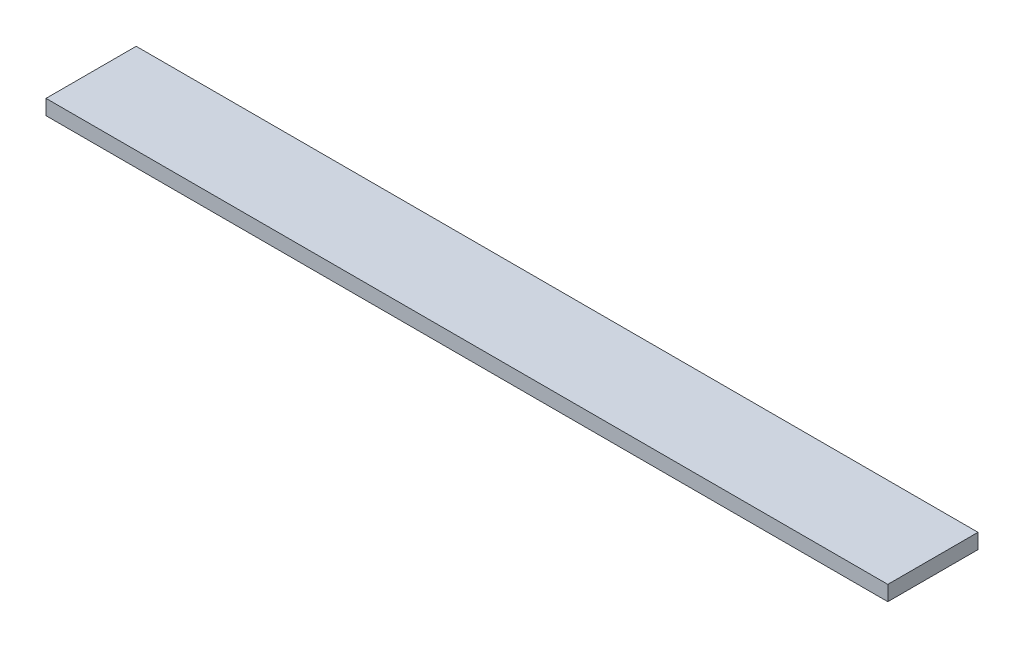
ISO-10303-21;
HEADER;
FILE_DESCRIPTION(('STEP AP214'),'2;1');
FILE_NAME('part.step','',(''),(''),'','','');
FILE_SCHEMA(('AUTOMOTIVE_DESIGN { 1 0 10303 214 1 1 1 1 }'));
ENDSEC;
DATA;
#1=APPLICATION_CONTEXT('core data for automotive mechanical design processes');
#2=APPLICATION_PROTOCOL_DEFINITION('international standard','automotive_design',2000,#1);
#3=PRODUCT_CONTEXT('',#1,'mechanical');
#4=PRODUCT('Part','Part','',(#3));
#5=PRODUCT_RELATED_PRODUCT_CATEGORY('part','',(#4));
#6=PRODUCT_DEFINITION_FORMATION('','',#4);
#7=PRODUCT_DEFINITION_CONTEXT('part definition',#1,'design');
#8=PRODUCT_DEFINITION('design','',#6,#7);
#9=PRODUCT_DEFINITION_SHAPE('','',#8);
#10=(LENGTH_UNIT() NAMED_UNIT(*) SI_UNIT(.MILLI.,.METRE.));
#11=(NAMED_UNIT(*) PLANE_ANGLE_UNIT() SI_UNIT($,.RADIAN.));
#12=(NAMED_UNIT(*) SI_UNIT($,.STERADIAN.) SOLID_ANGLE_UNIT());
#13=UNCERTAINTY_MEASURE_WITH_UNIT(LENGTH_MEASURE(1.E-05),#10,'distance_accuracy_value','');
#14=(GEOMETRIC_REPRESENTATION_CONTEXT(3) GLOBAL_UNCERTAINTY_ASSIGNED_CONTEXT((#13)) GLOBAL_UNIT_ASSIGNED_CONTEXT((#10,
#11,#12)) REPRESENTATION_CONTEXT('',''));
#15=CARTESIAN_POINT('',(0.,0.,0.));
#16=DIRECTION('',(0.,0.,1.));
#17=DIRECTION('',(1.,0.,0.));
#18=AXIS2_PLACEMENT_3D('',#15,#16,#17);
#19=CARTESIAN_POINT('',(0.,12.7,0.));
#20=DIRECTION('',(1.,0.,0.));
#21=DIRECTION('',(0.,0.,-1.));
#22=AXIS2_PLACEMENT_3D('',#19,#20,#21);
#23=PLANE('',#22);
#24=DIRECTION('',(0.,0.,1.));
#25=VECTOR('',#24,1.);
#26=CARTESIAN_POINT('',(0.,0.,0.));
#27=LINE('',#26,#25);
#28=CARTESIAN_POINT('',(0.,0.,-76.2));
#29=VERTEX_POINT('',#28);
#30=CARTESIAN_POINT('',(0.,0.,0.));
#31=VERTEX_POINT('',#30);
#32=EDGE_CURVE('E98',#29,#31,#27,.T.);
#33=ORIENTED_EDGE('',*,*,#32,.T.);
#34=DIRECTION('',(0.,-1.,0.));
#35=VECTOR('',#34,1.);
#36=CARTESIAN_POINT('',(0.,12.7,0.));
#37=LINE('',#36,#35);
#38=CARTESIAN_POINT('',(0.,12.7,0.));
#39=VERTEX_POINT('',#38);
#40=EDGE_CURVE('E11',#39,#31,#37,.T.);
#41=ORIENTED_EDGE('',*,*,#40,.F.);
#42=DIRECTION('',(0.,0.,1.));
#43=VECTOR('',#42,1.);
#44=CARTESIAN_POINT('',(0.,12.7,0.));
#45=LINE('',#44,#43);
#46=CARTESIAN_POINT('',(0.,12.7,-76.2));
#47=VERTEX_POINT('',#46);
#48=EDGE_CURVE('E86',#47,#39,#45,.T.);
#49=ORIENTED_EDGE('',*,*,#48,.F.);
#50=DIRECTION('',(0.,-1.,0.));
#51=VECTOR('',#50,1.);
#52=CARTESIAN_POINT('',(0.,12.7,-76.2));
#53=LINE('',#52,#51);
#54=EDGE_CURVE('E94',#47,#29,#53,.T.);
#55=ORIENTED_EDGE('',*,*,#54,.T.);
#56=EDGE_LOOP('',(#33,#41,#49,#55));
#57=FACE_BOUND('',#56,.T.);
#58=ADVANCED_FACE('F35',(#57),#23,.F.);
#59=CARTESIAN_POINT('',(0.,12.7,0.));
#60=DIRECTION('',(0.,0.,-1.));
#61=DIRECTION('',(-1.,0.,0.));
#62=AXIS2_PLACEMENT_3D('',#59,#60,#61);
#63=PLANE('',#62);
#64=DIRECTION('',(1.,0.,0.));
#65=VECTOR('',#64,1.);
#66=CARTESIAN_POINT('',(0.,0.,0.));
#67=LINE('',#66,#65);
#68=CARTESIAN_POINT('',(711.2,0.,0.));
#69=VERTEX_POINT('',#68);
#70=EDGE_CURVE('E90',#31,#69,#67,.T.);
#71=ORIENTED_EDGE('',*,*,#70,.T.);
#72=DIRECTION('',(0.,-1.,0.));
#73=VECTOR('',#72,1.);
#74=CARTESIAN_POINT('',(711.2,12.7,0.));
#75=LINE('',#74,#73);
#76=CARTESIAN_POINT('',(711.2,12.7,0.));
#77=VERTEX_POINT('',#76);
#78=EDGE_CURVE('E43',#77,#69,#75,.T.);
#79=ORIENTED_EDGE('',*,*,#78,.F.);
#80=DIRECTION('',(1.,0.,0.));
#81=VECTOR('',#80,1.);
#82=CARTESIAN_POINT('',(0.,12.7,0.));
#83=LINE('',#82,#81);
#84=EDGE_CURVE('E81',#39,#77,#83,.T.);
#85=ORIENTED_EDGE('',*,*,#84,.F.);
#86=ORIENTED_EDGE('',*,*,#40,.T.);
#87=EDGE_LOOP('',(#71,#79,#85,#86));
#88=FACE_BOUND('',#87,.T.);
#89=ADVANCED_FACE('F89',(#88),#63,.F.);
#90=CARTESIAN_POINT('',(711.2,12.7,0.));
#91=DIRECTION('',(-1.,0.,0.));
#92=DIRECTION('',(0.,0.,1.));
#93=AXIS2_PLACEMENT_3D('',#90,#91,#92);
#94=PLANE('',#93);
#95=DIRECTION('',(0.,0.,-1.));
#96=VECTOR('',#95,1.);
#97=CARTESIAN_POINT('',(711.2,0.,0.));
#98=LINE('',#97,#96);
#99=CARTESIAN_POINT('',(711.2,0.,-76.2));
#100=VERTEX_POINT('',#99);
#101=EDGE_CURVE('E68',#69,#100,#98,.T.);
#102=ORIENTED_EDGE('',*,*,#101,.T.);
#103=DIRECTION('',(0.,-1.,0.));
#104=VECTOR('',#103,1.);
#105=CARTESIAN_POINT('',(711.2,12.7,-76.2));
#106=LINE('',#105,#104);
#107=CARTESIAN_POINT('',(711.2,12.7,-76.2));
#108=VERTEX_POINT('',#107);
#109=EDGE_CURVE('E91',#108,#100,#106,.T.);
#110=ORIENTED_EDGE('',*,*,#109,.F.);
#111=DIRECTION('',(0.,0.,-1.));
#112=VECTOR('',#111,1.);
#113=CARTESIAN_POINT('',(711.2,12.7,0.));
#114=LINE('',#113,#112);
#115=EDGE_CURVE('E84',#77,#108,#114,.T.);
#116=ORIENTED_EDGE('',*,*,#115,.F.);
#117=ORIENTED_EDGE('',*,*,#78,.T.);
#118=EDGE_LOOP('',(#102,#110,#116,#117));
#119=FACE_BOUND('',#118,.T.);
#120=ADVANCED_FACE('F92',(#119),#94,.F.);
#121=CARTESIAN_POINT('',(0.,12.7,-76.2));
#122=DIRECTION('',(0.,0.,1.));
#123=DIRECTION('',(1.,0.,0.));
#124=AXIS2_PLACEMENT_3D('',#121,#122,#123);
#125=PLANE('',#124);
#126=DIRECTION('',(-1.,0.,0.));
#127=VECTOR('',#126,1.);
#128=CARTESIAN_POINT('',(0.,0.,-76.2));
#129=LINE('',#128,#127);
#130=EDGE_CURVE('E74',#100,#29,#129,.T.);
#131=ORIENTED_EDGE('',*,*,#130,.T.);
#132=ORIENTED_EDGE('',*,*,#54,.F.);
#133=DIRECTION('',(-1.,0.,0.));
#134=VECTOR('',#133,1.);
#135=CARTESIAN_POINT('',(0.,12.7,-76.2));
#136=LINE('',#135,#134);
#137=EDGE_CURVE('E51',#108,#47,#136,.T.);
#138=ORIENTED_EDGE('',*,*,#137,.F.);
#139=ORIENTED_EDGE('',*,*,#109,.T.);
#140=EDGE_LOOP('',(#131,#132,#138,#139));
#141=FACE_BOUND('',#140,.T.);
#142=ADVANCED_FACE('F105',(#141),#125,.F.);
#143=CARTESIAN_POINT('',(0.,12.7,0.));
#144=DIRECTION('',(0.,-1.,0.));
#145=DIRECTION('',(0.,0.,-1.));
#146=AXIS2_PLACEMENT_3D('',#143,#144,#145);
#147=PLANE('',#146);
#148=ORIENTED_EDGE('',*,*,#48,.T.);
#149=ORIENTED_EDGE('',*,*,#84,.T.);
#150=ORIENTED_EDGE('',*,*,#115,.T.);
#151=ORIENTED_EDGE('',*,*,#137,.T.);
#152=EDGE_LOOP('',(#148,#149,#150,#151));
#153=FACE_BOUND('',#152,.T.);
#154=ADVANCED_FACE('F82',(#153),#147,.F.);
#155=CARTESIAN_POINT('',(0.,0.,0.));
#156=DIRECTION('',(0.,-1.,0.));
#157=DIRECTION('',(0.,0.,-1.));
#158=AXIS2_PLACEMENT_3D('',#155,#156,#157);
#159=PLANE('',#158);
#160=ORIENTED_EDGE('',*,*,#32,.F.);
#161=ORIENTED_EDGE('',*,*,#130,.F.);
#162=ORIENTED_EDGE('',*,*,#101,.F.);
#163=ORIENTED_EDGE('',*,*,#70,.F.);
#164=EDGE_LOOP('',(#160,#161,#162,#163));
#165=FACE_BOUND('',#164,.T.);
#166=ADVANCED_FACE('F108',(#165),#159,.T.);
#167=CLOSED_SHELL('',(#58,#89,#120,#142,#154,#166));
#168=MANIFOLD_SOLID_BREP('B2',#167);
#169=ADVANCED_BREP_SHAPE_REPRESENTATION('',(#18,#168),#14);
#170=SHAPE_DEFINITION_REPRESENTATION(#9,#169);
ENDSEC;
END-ISO-10303-21;
